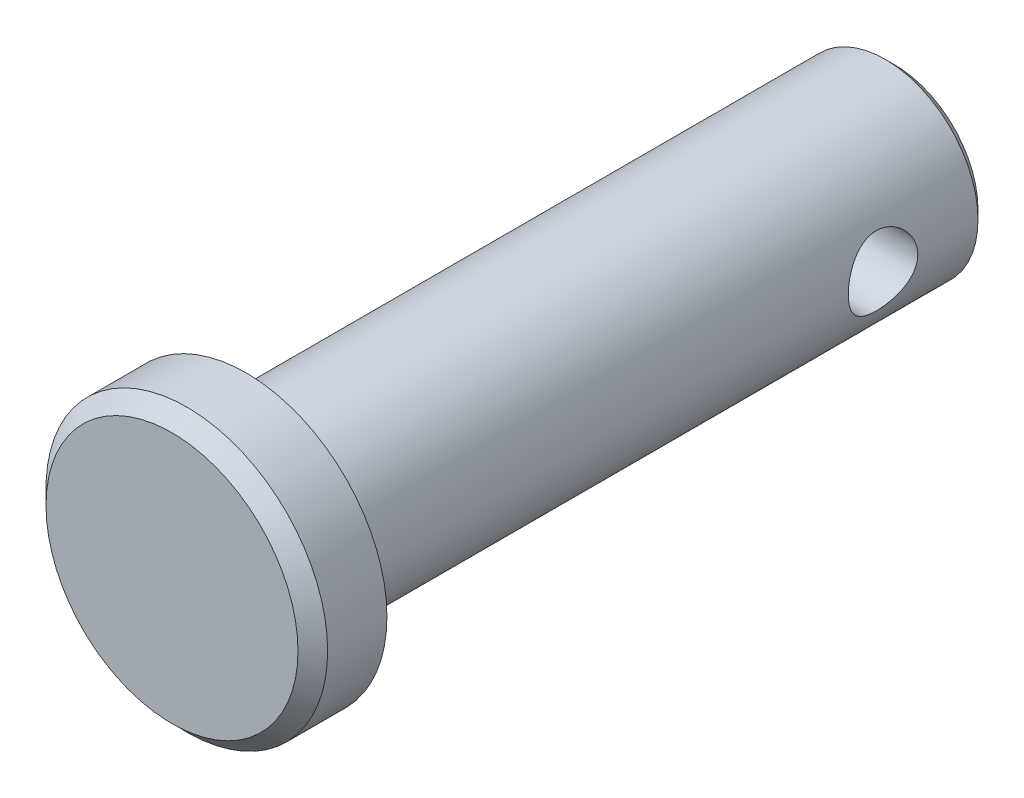
ISO-10303-21;
HEADER;
FILE_DESCRIPTION(('STEP AP214'),'2;1');
FILE_NAME('part.step','',(''),(''),'','','');
FILE_SCHEMA(('AUTOMOTIVE_DESIGN { 1 0 10303 214 1 1 1 1 }'));
ENDSEC;
DATA;
#1=APPLICATION_CONTEXT('core data for automotive mechanical design processes');
#2=APPLICATION_PROTOCOL_DEFINITION('international standard','automotive_design',2000,#1);
#3=PRODUCT_CONTEXT('',#1,'mechanical');
#4=PRODUCT('Part','Part','',(#3));
#5=PRODUCT_RELATED_PRODUCT_CATEGORY('part','',(#4));
#6=PRODUCT_DEFINITION_FORMATION('','',#4);
#7=PRODUCT_DEFINITION_CONTEXT('part definition',#1,'design');
#8=PRODUCT_DEFINITION('design','',#6,#7);
#9=PRODUCT_DEFINITION_SHAPE('','',#8);
#10=(LENGTH_UNIT() NAMED_UNIT(*) SI_UNIT(.MILLI.,.METRE.));
#11=(NAMED_UNIT(*) PLANE_ANGLE_UNIT() SI_UNIT($,.RADIAN.));
#12=(NAMED_UNIT(*) SI_UNIT($,.STERADIAN.) SOLID_ANGLE_UNIT());
#13=UNCERTAINTY_MEASURE_WITH_UNIT(LENGTH_MEASURE(1.E-05),#10,'distance_accuracy_value','');
#14=(GEOMETRIC_REPRESENTATION_CONTEXT(3) GLOBAL_UNCERTAINTY_ASSIGNED_CONTEXT((#13)) GLOBAL_UNIT_ASSIGNED_CONTEXT((#10,
#11,#12)) REPRESENTATION_CONTEXT('',''));
#15=CARTESIAN_POINT('',(0.,0.,0.));
#16=DIRECTION('',(0.,0.,1.));
#17=DIRECTION('',(1.,0.,0.));
#18=AXIS2_PLACEMENT_3D('',#15,#16,#17);
#19=CARTESIAN_POINT('',(0.,0.,11.1125));
#20=DIRECTION('',(0.,0.,-1.));
#21=DIRECTION('',(-1.,0.,0.));
#22=AXIS2_PLACEMENT_3D('',#19,#20,#21);
#23=CYLINDRICAL_SURFACE('',#22,3.175);
#24=CARTESIAN_POINT('',(0.,0.,-10.795));
#25=DIRECTION('',(0.,0.,1.));
#26=DIRECTION('',(1.,0.,0.));
#27=AXIS2_PLACEMENT_3D('',#24,#25,#26);
#28=CIRCLE('',#27,3.175);
#29=CARTESIAN_POINT('',(3.175,0.,-10.795));
#30=VERTEX_POINT('',#29);
#31=EDGE_CURVE('E40',#30,#30,#28,.T.);
#32=ORIENTED_EDGE('',*,*,#31,.T.);
#33=EDGE_LOOP('',(#32));
#34=FACE_BOUND('',#33,.T.);
#35=CARTESIAN_POINT('',(-3.175,0.,-6.34999999999999));
#36=CARTESIAN_POINT('',(-3.1750017260582,-0.0644803280319208,-6.3499976962969));
#37=CARTESIAN_POINT('',(-3.17301863556027,-0.128944879414298,-6.35525443469715));
#38=CARTESIAN_POINT('',(-3.16530589955499,-0.255947427804687,-6.3760573799955));
#39=CARTESIAN_POINT('',(-3.15957679372107,-0.318485700965171,-6.39160210474851));
#40=CARTESIAN_POINT('',(-3.14498698210789,-0.439785748086511,-6.43235394515633));
#41=CARTESIAN_POINT('',(-3.13613231952368,-0.498554552928809,-6.45754242272729));
#42=CARTESIAN_POINT('',(-3.11617334413749,-0.611028202439703,-6.5167719653313));
#43=CARTESIAN_POINT('',(-3.10506842811866,-0.664731683597443,-6.55081540477567));
#44=CARTESIAN_POINT('',(-3.08122833533403,-0.767831218530126,-6.62829869653753));
#45=CARTESIAN_POINT('',(-3.06844702050705,-0.81698364205751,-6.67204839566839));
#46=CARTESIAN_POINT('',(-3.04292175316615,-0.907450095452759,-6.76704453251045));
#47=CARTESIAN_POINT('',(-3.03017781325932,-0.948761726101173,-6.81829325639474));
#48=CARTESIAN_POINT('',(-3.00563336052824,-1.02392323008938,-6.92921323984654));
#49=CARTESIAN_POINT('',(-2.99388727501525,-1.05742893349134,-6.98913096594574));
#50=CARTESIAN_POINT('',(-2.97338639063463,-1.1137792552768,-7.11426088112126));
#51=CARTESIAN_POINT('',(-2.96463039737105,-1.13662813187984,-7.17947094325436));
#52=CARTESIAN_POINT('',(-2.95159440179158,-1.1700544212018,-7.31053016257994));
#53=CARTESIAN_POINT('',(-2.94714552453477,-1.18109677117231,-7.37624337425813));
#54=CARTESIAN_POINT('',(-2.94273336284839,-1.19205022996996,-7.50872907540761));
#55=CARTESIAN_POINT('',(-2.94276822592073,-1.19196593587088,-7.57550111601286));
#56=CARTESIAN_POINT('',(-2.94717399857943,-1.18102403502952,-7.70395456063778));
#57=CARTESIAN_POINT('',(-2.95128528416453,-1.17081148004022,-7.76570146917256));
#58=CARTESIAN_POINT('',(-2.96294919584751,-1.14096933245487,-7.88653105063422));
#59=CARTESIAN_POINT('',(-2.97050234018472,-1.12133832170212,-7.94561332087476));
#60=CARTESIAN_POINT('',(-2.98835526113513,-1.07286225428949,-8.06075117250928));
#61=CARTESIAN_POINT('',(-2.99870429903106,-1.04384989935074,-8.11672834210878));
#62=CARTESIAN_POINT('',(-3.02096654298085,-0.977551335491416,-8.22320692921283));
#63=CARTESIAN_POINT('',(-3.03288028850369,-0.940262269910619,-8.27370644715626));
#64=CARTESIAN_POINT('',(-3.05790630844421,-0.855517884834483,-8.37136665802288));
#65=CARTESIAN_POINT('',(-3.07104532042939,-0.807547746065837,-8.4180748585938));
#66=CARTESIAN_POINT('',(-3.09635309230243,-0.7043043689626,-8.50291826067585));
#67=CARTESIAN_POINT('',(-3.10852170288599,-0.649030010276035,-8.54105214459325));
#68=CARTESIAN_POINT('',(-3.13075950879707,-0.531592978112735,-8.60816350266837));
#69=CARTESIAN_POINT('',(-3.1407933299357,-0.469337004114248,-8.63699026759421));
#70=CARTESIAN_POINT('',(-3.15736857672026,-0.340389250103889,-8.68361119213934));
#71=CARTESIAN_POINT('',(-3.1639115533356,-0.273699454858829,-8.70141025189539));
#72=CARTESIAN_POINT('',(-3.17249526812277,-0.141585349249254,-8.72460058761141));
#73=CARTESIAN_POINT('',(-3.17475686664138,-0.0762822480275041,-8.73060119381612));
#74=CARTESIAN_POINT('',(-3.17520553124475,0.0544294022336754,-8.73179853197056));
#75=CARTESIAN_POINT('',(-3.17339350069573,0.119837924680552,-8.72699765925144));
#76=CARTESIAN_POINT('',(-3.16604419632035,0.246270501045976,-8.70719140391749));
#77=CARTESIAN_POINT('',(-3.16065273826329,0.307366454105823,-8.69258521215869));
#78=CARTESIAN_POINT('',(-3.1468335994155,0.426197517997295,-8.65410855491556));
#79=CARTESIAN_POINT('',(-3.13840552373861,0.483932190588356,-8.63023688450374));
#80=CARTESIAN_POINT('',(-3.11903764373597,0.596302913556187,-8.57314578512617));
#81=CARTESIAN_POINT('',(-3.1080313141617,0.650798072574001,-8.53967230242893));
#82=CARTESIAN_POINT('',(-3.08472420554452,0.75358046493301,-8.46461500560757));
#83=CARTESIAN_POINT('',(-3.07242294938803,0.801865395464672,-8.42302819729228));
#84=CARTESIAN_POINT('',(-3.04699455283473,0.893786946503482,-8.33008547806386));
#85=CARTESIAN_POINT('',(-3.03386090349835,0.936991348355826,-8.27830276742417));
#86=CARTESIAN_POINT('',(-3.00893809999065,1.01418270962823,-8.1679642133883));
#87=CARTESIAN_POINT('',(-2.99714906660554,1.04816884135274,-8.10940776246038));
#88=CARTESIAN_POINT('',(-2.9762992117158,1.10599357730705,-7.98669981049947));
#89=CARTESIAN_POINT('',(-2.96724991010741,1.12978950323491,-7.92252610793359));
#90=CARTESIAN_POINT('',(-2.95317888607235,1.16608132501843,-7.79064850007279));
#91=CARTESIAN_POINT('',(-2.94815467214383,1.17858421180019,-7.72294680626774));
#92=CARTESIAN_POINT('',(-2.94303366491605,1.1913103800891,-7.59061842336424));
#93=CARTESIAN_POINT('',(-2.94264115340402,1.19227069374821,-7.52607347357472));
#94=CARTESIAN_POINT('',(-2.94606990116575,1.18377268040514,-7.39779340520579));
#95=CARTESIAN_POINT('',(-2.94989076088501,1.17431534131036,-7.33405821041693));
#96=CARTESIAN_POINT('',(-2.96106962383437,1.14582428656505,-7.21118126379373));
#97=CARTESIAN_POINT('',(-2.96831611517726,1.12709164913741,-7.15195868766775));
#98=CARTESIAN_POINT('',(-2.98546478961414,1.08084696819061,-7.03746250263255));
#99=CARTESIAN_POINT('',(-2.99536764396201,1.0533327052505,-6.98218989634432));
#100=CARTESIAN_POINT('',(-3.01735905848772,0.988632102759098,-6.8740124856775));
#101=CARTESIAN_POINT('',(-3.02953498137515,0.951014360373896,-6.82138368004007));
#102=CARTESIAN_POINT('',(-3.05439958363509,0.867842480481132,-6.7229501359791));
#103=CARTESIAN_POINT('',(-3.06708842498621,0.822285820601668,-6.67714757501301));
#104=CARTESIAN_POINT('',(-3.09237399534093,0.721582564947797,-6.59113969756641));
#105=CARTESIAN_POINT('',(-3.10492858264887,0.666050423844065,-6.55137139571122));
#106=CARTESIAN_POINT('',(-3.12780770850268,0.548650495915653,-6.48174451737423));
#107=CARTESIAN_POINT('',(-3.13813207344675,0.486782216434432,-6.45188671223425));
#108=CARTESIAN_POINT('',(-3.15574594756552,0.355599271339336,-6.40208839194288));
#109=CARTESIAN_POINT('',(-3.16288465369445,0.286078153898403,-6.38263339247224));
#110=CARTESIAN_POINT('',(-3.17250954730047,0.144363863550066,-6.35659371306295));
#111=CARTESIAN_POINT('',(-3.17499806804399,0.0721720492396069,-6.35000257850693));
#112=CARTESIAN_POINT('',(-3.175,0.,-6.34999999999999));
#113=B_SPLINE_CURVE_WITH_KNOTS('',3,(#35,#36,#37,#38,#39,#40,#41,#42,#43,#44,#45,#46,#47,#48,
#49,#50,#51,#52,#53,#54,#55,#56,#57,#58,#59,#60,#61,#62,#63,#64,#65,#66,#67,#68,#69,#70,#71,#72,
#73,#74,#75,#76,#77,#78,#79,#80,#81,#82,#83,#84,#85,#86,#87,#88,#89,#90,#91,#92,#93,#94,#95,#96,
#97,#98,#99,#100,#101,#102,#103,#104,#105,#106,#107,#108,#109,#110,#111,#112),.UNSPECIFIED.,.T.,
.F.,(4,2,2,2,2,2,2,2,2,2,2,2,2,2,2,2,2,2,2,2,2,2,2,2,2,2,2,2,2,2,2,2,2,2,2,2,2,2,4),(0.,
0.193174779988695,0.386321736189804,0.579097274313275,0.771924557565034,0.972134347500306,
1.17240530159712,1.38030485385692,1.58812126298257,1.78741287818416,1.98662215450768,
2.17390936438978,2.36122478335593,2.55208411657196,2.74300942653256,2.94676634210302,
3.15055454712147,3.35749404133323,3.5643415163596,3.76019234336017,3.95599974284977,
4.14428335102049,4.33259145270724,4.52643257351058,4.72034536640771,4.92550862317929,
5.13069029517863,5.33672309214719,5.54262825746729,5.73531018512451,5.92797384230188,
6.11475744301062,6.30158828783603,6.49821274558141,6.69489978960169,6.90223036662895,
7.10957707657801,7.32590383806685,7.54212202675678),.UNSPECIFIED.);
#114=CARTESIAN_POINT('',(-3.175,0.,-6.34999999999999));
#115=VERTEX_POINT('',#114);
#116=EDGE_CURVE('E51',#115,#115,#113,.T.);
#117=ORIENTED_EDGE('',*,*,#116,.T.);
#118=EDGE_LOOP('',(#117));
#119=FACE_BOUND('',#118,.T.);
#120=CARTESIAN_POINT('',(3.175,0.,-8.73125));
#121=CARTESIAN_POINT('',(3.1750017260582,-0.0644803280319209,-8.73125230370309));
#122=CARTESIAN_POINT('',(3.17301863556027,-0.128944879414298,-8.72599556530285));
#123=CARTESIAN_POINT('',(3.16530589955499,-0.255947427804687,-8.70519262000449));
#124=CARTESIAN_POINT('',(3.15957679372107,-0.318485700965171,-8.68964789525149));
#125=CARTESIAN_POINT('',(3.14498698210789,-0.439785748086511,-8.64889605484366));
#126=CARTESIAN_POINT('',(3.13613231952368,-0.498554552928809,-8.6237075772727));
#127=CARTESIAN_POINT('',(3.11617334413749,-0.611028202439702,-8.56447803466869));
#128=CARTESIAN_POINT('',(3.10506842811866,-0.664731683597443,-8.53043459522432));
#129=CARTESIAN_POINT('',(3.08122833533403,-0.767831218530126,-8.45295130346246));
#130=CARTESIAN_POINT('',(3.06844702050705,-0.81698364205751,-8.4092016043316));
#131=CARTESIAN_POINT('',(3.04292175316615,-0.907450095452759,-8.31420546748954));
#132=CARTESIAN_POINT('',(3.03017781325932,-0.948761726101172,-8.26295674360525));
#133=CARTESIAN_POINT('',(3.00563336052824,-1.02392323008938,-8.15203676015345));
#134=CARTESIAN_POINT('',(2.99388727501525,-1.05742893349134,-8.09211903405425));
#135=CARTESIAN_POINT('',(2.97338639063462,-1.1137792552768,-7.96698911887873));
#136=CARTESIAN_POINT('',(2.96463039737105,-1.13662813187984,-7.90177905674563));
#137=CARTESIAN_POINT('',(2.95159440179158,-1.1700544212018,-7.77071983742005));
#138=CARTESIAN_POINT('',(2.94714552453477,-1.1810967711723,-7.70500662574186));
#139=CARTESIAN_POINT('',(2.94273336284839,-1.19205022996996,-7.57252092459238));
#140=CARTESIAN_POINT('',(2.94276822592073,-1.19196593587088,-7.50574888398714));
#141=CARTESIAN_POINT('',(2.94717399857943,-1.18102403502952,-7.37729543936221));
#142=CARTESIAN_POINT('',(2.95128528416453,-1.17081148004022,-7.31554853082743));
#143=CARTESIAN_POINT('',(2.96294919584751,-1.14096933245487,-7.19471894936577));
#144=CARTESIAN_POINT('',(2.97050234018472,-1.12133832170212,-7.13563667912523));
#145=CARTESIAN_POINT('',(2.98835526113513,-1.07286225428949,-7.02049882749071));
#146=CARTESIAN_POINT('',(2.99870429903106,-1.04384989935074,-6.96452165789121));
#147=CARTESIAN_POINT('',(3.02096654298085,-0.977551335491416,-6.85804307078716));
#148=CARTESIAN_POINT('',(3.03288028850369,-0.940262269910619,-6.80754355284373));
#149=CARTESIAN_POINT('',(3.05790630844421,-0.855517884834483,-6.70988334197711));
#150=CARTESIAN_POINT('',(3.07104532042938,-0.807547746065836,-6.66317514140619));
#151=CARTESIAN_POINT('',(3.09635309230243,-0.7043043689626,-6.57833173932414));
#152=CARTESIAN_POINT('',(3.10852170288599,-0.649030010276035,-6.54019785540674));
#153=CARTESIAN_POINT('',(3.13075950879707,-0.531592978112735,-6.47308649733162));
#154=CARTESIAN_POINT('',(3.1407933299357,-0.469337004114248,-6.44425973240577));
#155=CARTESIAN_POINT('',(3.15736857672026,-0.34038925010389,-6.39763880786065));
#156=CARTESIAN_POINT('',(3.1639115533356,-0.273699454858829,-6.37983974810461));
#157=CARTESIAN_POINT('',(3.17249526812277,-0.141585349249254,-6.35664941238858));
#158=CARTESIAN_POINT('',(3.17475686664138,-0.076282248027505,-6.35064880618387));
#159=CARTESIAN_POINT('',(3.17520553124475,0.0544294022336744,-6.34945146802943));
#160=CARTESIAN_POINT('',(3.17339350069573,0.119837924680551,-6.35425234074855));
#161=CARTESIAN_POINT('',(3.16604419632035,0.246270501045975,-6.3740585960825));
#162=CARTESIAN_POINT('',(3.16065273826329,0.307366454105823,-6.3886647878413));
#163=CARTESIAN_POINT('',(3.1468335994155,0.426197517997294,-6.42714144508443));
#164=CARTESIAN_POINT('',(3.13840552373861,0.483932190588356,-6.45101311549625));
#165=CARTESIAN_POINT('',(3.11903764373597,0.596302913556186,-6.50810421487383));
#166=CARTESIAN_POINT('',(3.1080313141617,0.650798072574,-6.54157769757105));
#167=CARTESIAN_POINT('',(3.08472420554452,0.753580464933009,-6.61663499439241));
#168=CARTESIAN_POINT('',(3.07242294938803,0.801865395464671,-6.65822180270771));
#169=CARTESIAN_POINT('',(3.04699455283473,0.893786946503482,-6.75116452193613));
#170=CARTESIAN_POINT('',(3.03386090349835,0.936991348355826,-6.80294723257582));
#171=CARTESIAN_POINT('',(3.00893809999065,1.01418270962823,-6.9132857866117));
#172=CARTESIAN_POINT('',(2.99714906660554,1.04816884135274,-6.97184223753961));
#173=CARTESIAN_POINT('',(2.9762992117158,1.10599357730705,-7.09455018950052));
#174=CARTESIAN_POINT('',(2.96724991010742,1.12978950323491,-7.1587238920664));
#175=CARTESIAN_POINT('',(2.95317888607235,1.16608132501843,-7.2906014999272));
#176=CARTESIAN_POINT('',(2.94815467214383,1.17858421180019,-7.35830319373225));
#177=CARTESIAN_POINT('',(2.94303366491605,1.1913103800891,-7.49063157663575));
#178=CARTESIAN_POINT('',(2.94264115340402,1.19227069374821,-7.55517652642527));
#179=CARTESIAN_POINT('',(2.94606990116575,1.18377268040514,-7.6834565947942));
#180=CARTESIAN_POINT('',(2.94989076088501,1.17431534131036,-7.74719178958307));
#181=CARTESIAN_POINT('',(2.96106962383437,1.14582428656505,-7.87006873620626));
#182=CARTESIAN_POINT('',(2.96831611517726,1.12709164913741,-7.92929131233224));
#183=CARTESIAN_POINT('',(2.98546478961414,1.08084696819061,-8.04378749736744));
#184=CARTESIAN_POINT('',(2.99536764396201,1.0533327052505,-8.09906010365567));
#185=CARTESIAN_POINT('',(3.01735905848772,0.988632102759098,-8.20723751432249));
#186=CARTESIAN_POINT('',(3.02953498137515,0.951014360373897,-8.25986631995992));
#187=CARTESIAN_POINT('',(3.05439958363509,0.867842480481132,-8.35829986402089));
#188=CARTESIAN_POINT('',(3.06708842498621,0.822285820601668,-8.40410242498698));
#189=CARTESIAN_POINT('',(3.09237399534093,0.721582564947796,-8.49011030243358));
#190=CARTESIAN_POINT('',(3.10492858264887,0.666050423844064,-8.52987860428877));
#191=CARTESIAN_POINT('',(3.12780770850268,0.548650495915653,-8.59950548262576));
#192=CARTESIAN_POINT('',(3.13813207344675,0.486782216434432,-8.62936328776574));
#193=CARTESIAN_POINT('',(3.15574594756552,0.355599271339337,-8.67916160805711));
#194=CARTESIAN_POINT('',(3.16288465369445,0.286078153898404,-8.69861660752775));
#195=CARTESIAN_POINT('',(3.17250954730047,0.144363863550066,-8.72465628693704));
#196=CARTESIAN_POINT('',(3.17499806804399,0.0721720492396071,-8.73124742149306));
#197=CARTESIAN_POINT('',(3.175,0.,-8.73125));
#198=B_SPLINE_CURVE_WITH_KNOTS('',3,(#120,#121,#122,#123,#124,#125,#126,#127,#128,#129,#130,
#131,#132,#133,#134,#135,#136,#137,#138,#139,#140,#141,#142,#143,#144,#145,#146,#147,#148,#149,
#150,#151,#152,#153,#154,#155,#156,#157,#158,#159,#160,#161,#162,#163,#164,#165,#166,#167,#168,
#169,#170,#171,#172,#173,#174,#175,#176,#177,#178,#179,#180,#181,#182,#183,#184,#185,#186,#187,
#188,#189,#190,#191,#192,#193,#194,#195,#196,#197),.UNSPECIFIED.,.T.,.F.,(4,2,2,2,2,2,2,2,2,2,2,
2,2,2,2,2,2,2,2,2,2,2,2,2,2,2,2,2,2,2,2,2,2,2,2,2,2,2,4),(0.,0.193174779988695,
0.386321736189804,0.579097274313276,0.771924557565034,0.972134347500306,1.17240530159712,
1.38030485385692,1.58812126298256,1.78741287818416,1.98662215450768,2.17390936438978,
2.36122478335593,2.55208411657196,2.74300942653256,2.94676634210302,3.15055454712147,
3.35749404133323,3.56434151635959,3.76019234336016,3.95599974284976,4.14428335102049,
4.33259145270723,4.52643257351058,4.72034536640771,4.92550862317929,5.13069029517863,
5.33672309214719,5.54262825746729,5.73531018512451,5.92797384230188,6.11475744301062,
6.30158828783603,6.49821274558141,6.69489978960169,6.90223036662895,7.10957707657801,
7.32590383806685,7.54212202675678),.UNSPECIFIED.);
#199=CARTESIAN_POINT('',(3.175,0.,-8.73125));
#200=VERTEX_POINT('',#199);
#201=EDGE_CURVE('E60',#200,#200,#198,.T.);
#202=ORIENTED_EDGE('',*,*,#201,.T.);
#203=EDGE_LOOP('',(#202));
#204=FACE_BOUND('',#203,.T.);
#205=CARTESIAN_POINT('',(0.,0.,11.1125));
#206=DIRECTION('',(0.,0.,1.));
#207=DIRECTION('',(1.,0.,0.));
#208=AXIS2_PLACEMENT_3D('',#205,#206,#207);
#209=CIRCLE('',#208,3.175);
#210=CARTESIAN_POINT('',(3.175,0.,11.1125));
#211=VERTEX_POINT('',#210);
#212=EDGE_CURVE('E99',#211,#211,#209,.T.);
#213=ORIENTED_EDGE('',*,*,#212,.F.);
#214=EDGE_LOOP('',(#213));
#215=FACE_BOUND('',#214,.T.);
#216=ADVANCED_FACE('F33',(#34,#119,#204,#215),#23,.T.);
#217=CARTESIAN_POINT('',(0.,0.,-11.1125));
#218=DIRECTION('',(0.,0.,1.));
#219=DIRECTION('',(1.,0.,0.));
#220=AXIS2_PLACEMENT_3D('',#217,#218,#219);
#221=PLANE('',#220);
#222=CARTESIAN_POINT('',(0.,0.,-11.1125));
#223=DIRECTION('',(0.,0.,1.));
#224=DIRECTION('',(1.,0.,0.));
#225=AXIS2_PLACEMENT_3D('',#222,#223,#224);
#226=CIRCLE('',#225,2.8575);
#227=CARTESIAN_POINT('',(2.8575,0.,-11.1125));
#228=VERTEX_POINT('',#227);
#229=EDGE_CURVE('E10',#228,#228,#226,.F.);
#230=ORIENTED_EDGE('',*,*,#229,.T.);
#231=EDGE_LOOP('',(#230));
#232=FACE_BOUND('',#231,.T.);
#233=ADVANCED_FACE('F81',(#232),#221,.F.);
#234=CARTESIAN_POINT('',(0.,0.,11.1125));
#235=DIRECTION('',(0.,0.,1.));
#236=DIRECTION('',(1.,0.,0.));
#237=AXIS2_PLACEMENT_3D('',#234,#235,#236);
#238=PLANE('',#237);
#239=CARTESIAN_POINT('',(0.,0.,11.1125));
#240=DIRECTION('',(0.,0.,1.));
#241=DIRECTION('',(1.,0.,0.));
#242=AXIS2_PLACEMENT_3D('',#239,#240,#241);
#243=CIRCLE('',#242,4.826);
#244=CARTESIAN_POINT('',(4.826,0.,11.1125));
#245=VERTEX_POINT('',#244);
#246=EDGE_CURVE('E59',#245,#245,#243,.T.);
#247=ORIENTED_EDGE('',*,*,#246,.F.);
#248=EDGE_LOOP('',(#247));
#249=FACE_BOUND('',#248,.T.);
#250=ORIENTED_EDGE('',*,*,#212,.T.);
#251=EDGE_LOOP('',(#250));
#252=FACE_BOUND('',#251,.T.);
#253=ADVANCED_FACE('F78',(#249,#252),#238,.F.);
#254=CARTESIAN_POINT('',(0.,0.,13.6525));
#255=DIRECTION('',(0.,0.,-1.));
#256=DIRECTION('',(-1.,0.,0.));
#257=AXIS2_PLACEMENT_3D('',#254,#255,#256);
#258=CYLINDRICAL_SURFACE('',#257,4.826);
#259=CARTESIAN_POINT('',(0.,0.,13.1445));
#260=DIRECTION('',(0.,0.,1.));
#261=DIRECTION('',(1.,0.,0.));
#262=AXIS2_PLACEMENT_3D('',#259,#260,#261);
#263=CIRCLE('',#262,4.826);
#264=CARTESIAN_POINT('',(4.826,0.,13.1445));
#265=VERTEX_POINT('',#264);
#266=EDGE_CURVE('E44',#265,#265,#263,.F.);
#267=ORIENTED_EDGE('',*,*,#266,.T.);
#268=EDGE_LOOP('',(#267));
#269=FACE_BOUND('',#268,.T.);
#270=ORIENTED_EDGE('',*,*,#246,.T.);
#271=EDGE_LOOP('',(#270));
#272=FACE_BOUND('',#271,.T.);
#273=ADVANCED_FACE('F76',(#269,#272),#258,.T.);
#274=CARTESIAN_POINT('',(0.,0.,13.6525));
#275=DIRECTION('',(0.,0.,1.));
#276=DIRECTION('',(1.,0.,0.));
#277=AXIS2_PLACEMENT_3D('',#274,#275,#276);
#278=PLANE('',#277);
#279=CARTESIAN_POINT('',(0.,0.,13.6525));
#280=DIRECTION('',(0.,0.,1.));
#281=DIRECTION('',(1.,0.,0.));
#282=AXIS2_PLACEMENT_3D('',#279,#280,#281);
#283=CIRCLE('',#282,4.318);
#284=CARTESIAN_POINT('',(4.318,0.,13.6525));
#285=VERTEX_POINT('',#284);
#286=EDGE_CURVE('E48',#285,#285,#283,.T.);
#287=ORIENTED_EDGE('',*,*,#286,.T.);
#288=EDGE_LOOP('',(#287));
#289=FACE_BOUND('',#288,.T.);
#290=ADVANCED_FACE('F72',(#289),#278,.T.);
#291=CARTESIAN_POINT('',(0.,0.,13.6525));
#292=DIRECTION('',(0.,0.,-1.));
#293=DIRECTION('',(-1.,0.,0.));
#294=AXIS2_PLACEMENT_3D('',#291,#292,#293);
#295=CONICAL_SURFACE('',#294,4.318,0.785398163397449);
#296=ORIENTED_EDGE('',*,*,#266,.F.);
#297=EDGE_LOOP('',(#296));
#298=FACE_BOUND('',#297,.T.);
#299=ORIENTED_EDGE('',*,*,#286,.F.);
#300=EDGE_LOOP('',(#299));
#301=FACE_BOUND('',#300,.T.);
#302=ADVANCED_FACE('F70',(#298,#301),#295,.T.);
#303=CARTESIAN_POINT('',(-4.826,0.,-7.540625));
#304=DIRECTION('',(1.,0.,0.));
#305=DIRECTION('',(0.,0.,-1.));
#306=AXIS2_PLACEMENT_3D('',#303,#304,#305);
#307=CYLINDRICAL_SURFACE('',#306,1.190625);
#308=ORIENTED_EDGE('',*,*,#201,.F.);
#309=EDGE_LOOP('',(#308));
#310=FACE_BOUND('',#309,.T.);
#311=ORIENTED_EDGE('',*,*,#116,.F.);
#312=EDGE_LOOP('',(#311));
#313=FACE_BOUND('',#312,.T.);
#314=ADVANCED_FACE('F66',(#310,#313),#307,.F.);
#315=CARTESIAN_POINT('',(0.,0.,-10.795));
#316=DIRECTION('',(0.,0.,1.));
#317=DIRECTION('',(1.,0.,0.));
#318=AXIS2_PLACEMENT_3D('',#315,#316,#317);
#319=CONICAL_SURFACE('',#318,3.175,0.785398163397452);
#320=ORIENTED_EDGE('',*,*,#229,.F.);
#321=EDGE_LOOP('',(#320));
#322=FACE_BOUND('',#321,.T.);
#323=ORIENTED_EDGE('',*,*,#31,.F.);
#324=EDGE_LOOP('',(#323));
#325=FACE_BOUND('',#324,.T.);
#326=ADVANCED_FACE('F35',(#322,#325),#319,.T.);
#327=CLOSED_SHELL('',(#216,#233,#253,#273,#290,#302,#314,#326));
#328=MANIFOLD_SOLID_BREP('B2',#327);
#329=ADVANCED_BREP_SHAPE_REPRESENTATION('',(#18,#328),#14);
#330=SHAPE_DEFINITION_REPRESENTATION(#9,#329);
ENDSEC;
END-ISO-10303-21;
